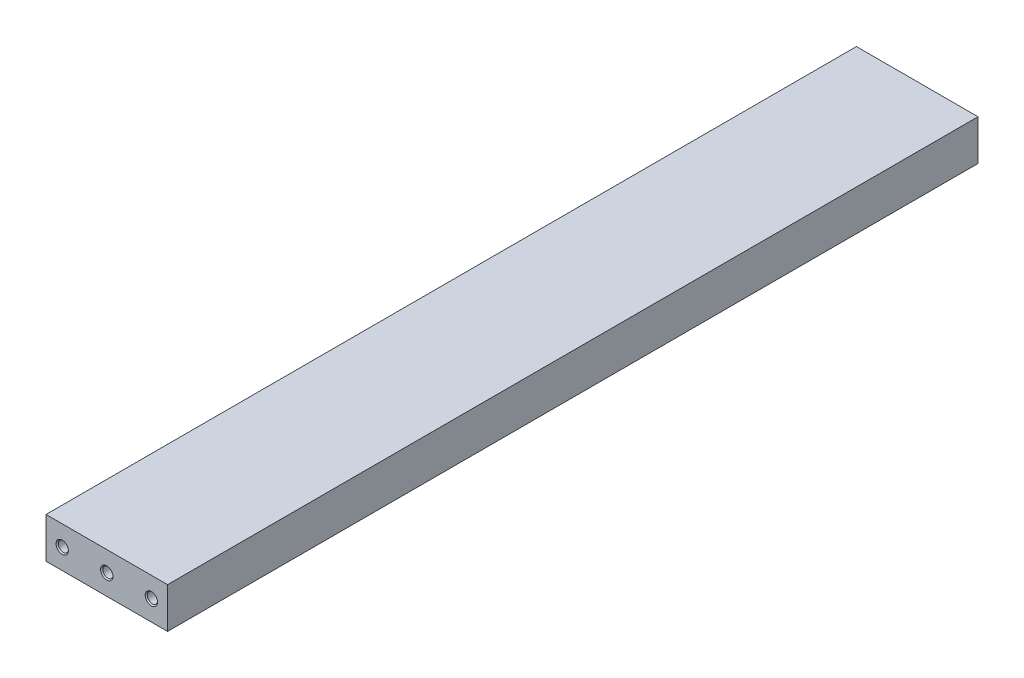
ISO-10303-21;
HEADER;
FILE_DESCRIPTION(('STEP AP214'),'2;1');
FILE_NAME('part.step','',(''),(''),'','','');
FILE_SCHEMA(('AUTOMOTIVE_DESIGN { 1 0 10303 214 1 1 1 1 }'));
ENDSEC;
DATA;
#1=APPLICATION_CONTEXT('core data for automotive mechanical design processes');
#2=APPLICATION_PROTOCOL_DEFINITION('international standard','automotive_design',2000,#1);
#3=PRODUCT_CONTEXT('',#1,'mechanical');
#4=PRODUCT('Part','Part','',(#3));
#5=PRODUCT_RELATED_PRODUCT_CATEGORY('part','',(#4));
#6=PRODUCT_DEFINITION_FORMATION('','',#4);
#7=PRODUCT_DEFINITION_CONTEXT('part definition',#1,'design');
#8=PRODUCT_DEFINITION('design','',#6,#7);
#9=PRODUCT_DEFINITION_SHAPE('','',#8);
#10=(LENGTH_UNIT() NAMED_UNIT(*) SI_UNIT(.MILLI.,.METRE.));
#11=(NAMED_UNIT(*) PLANE_ANGLE_UNIT() SI_UNIT($,.RADIAN.));
#12=(NAMED_UNIT(*) SI_UNIT($,.STERADIAN.) SOLID_ANGLE_UNIT());
#13=UNCERTAINTY_MEASURE_WITH_UNIT(LENGTH_MEASURE(1.E-05),#10,'distance_accuracy_value','');
#14=(GEOMETRIC_REPRESENTATION_CONTEXT(3) GLOBAL_UNCERTAINTY_ASSIGNED_CONTEXT((#13)) GLOBAL_UNIT_ASSIGNED_CONTEXT((#10,
#11,#12)) REPRESENTATION_CONTEXT('',''));
#15=CARTESIAN_POINT('',(0.,0.,0.));
#16=DIRECTION('',(0.,0.,1.));
#17=DIRECTION('',(1.,0.,0.));
#18=AXIS2_PLACEMENT_3D('',#15,#16,#17);
#19=CARTESIAN_POINT('',(0.,0.,210.));
#20=DIRECTION('',(1.,0.,0.));
#21=DIRECTION('',(0.,0.,-1.));
#22=AXIS2_PLACEMENT_3D('',#19,#20,#21);
#23=PLANE('',#22);
#24=DIRECTION('',(0.,1.,0.));
#25=VECTOR('',#24,1.);
#26=CARTESIAN_POINT('',(0.,0.,5.));
#27=LINE('',#26,#25);
#28=CARTESIAN_POINT('',(0.,0.,5.));
#29=VERTEX_POINT('',#28);
#30=CARTESIAN_POINT('',(0.,10.,5.));
#31=VERTEX_POINT('',#30);
#32=EDGE_CURVE('E53',#29,#31,#27,.T.);
#33=ORIENTED_EDGE('',*,*,#32,.F.);
#34=DIRECTION('',(0.,0.,-1.));
#35=VECTOR('',#34,1.);
#36=CARTESIAN_POINT('',(0.,0.,210.));
#37=LINE('',#36,#35);
#38=CARTESIAN_POINT('',(0.,0.,205.));
#39=VERTEX_POINT('',#38);
#40=EDGE_CURVE('E11',#39,#29,#37,.T.);
#41=ORIENTED_EDGE('',*,*,#40,.F.);
#42=DIRECTION('',(0.,1.,0.));
#43=VECTOR('',#42,1.);
#44=CARTESIAN_POINT('',(0.,0.,205.));
#45=LINE('',#44,#43);
#46=CARTESIAN_POINT('',(0.,10.,205.));
#47=VERTEX_POINT('',#46);
#48=EDGE_CURVE('E170',#39,#47,#45,.T.);
#49=ORIENTED_EDGE('',*,*,#48,.T.);
#50=DIRECTION('',(0.,0.,-1.));
#51=VECTOR('',#50,1.);
#52=CARTESIAN_POINT('',(0.,10.,210.));
#53=LINE('',#52,#51);
#54=EDGE_CURVE('E173',#47,#31,#53,.T.);
#55=ORIENTED_EDGE('',*,*,#54,.T.);
#56=EDGE_LOOP('',(#33,#41,#49,#55));
#57=FACE_BOUND('',#56,.T.);
#58=ADVANCED_FACE('F39',(#57),#23,.F.);
#59=CARTESIAN_POINT('',(0.,0.,210.));
#60=DIRECTION('',(0.,1.,0.));
#61=DIRECTION('',(0.,0.,1.));
#62=AXIS2_PLACEMENT_3D('',#59,#60,#61);
#63=PLANE('',#62);
#64=DIRECTION('',(-1.,0.,0.));
#65=VECTOR('',#64,1.);
#66=CARTESIAN_POINT('',(30.,0.,5.));
#67=LINE('',#66,#65);
#68=CARTESIAN_POINT('',(30.,0.,5.));
#69=VERTEX_POINT('',#68);
#70=EDGE_CURVE('E158',#69,#29,#67,.T.);
#71=ORIENTED_EDGE('',*,*,#70,.F.);
#72=DIRECTION('',(0.,0.,-1.));
#73=VECTOR('',#72,1.);
#74=CARTESIAN_POINT('',(30.,0.,210.));
#75=LINE('',#74,#73);
#76=CARTESIAN_POINT('',(30.,0.,205.));
#77=VERTEX_POINT('',#76);
#78=EDGE_CURVE('E46',#77,#69,#75,.T.);
#79=ORIENTED_EDGE('',*,*,#78,.F.);
#80=DIRECTION('',(-1.,0.,0.));
#81=VECTOR('',#80,1.);
#82=CARTESIAN_POINT('',(30.,0.,205.));
#83=LINE('',#82,#81);
#84=EDGE_CURVE('E166',#77,#39,#83,.T.);
#85=ORIENTED_EDGE('',*,*,#84,.T.);
#86=ORIENTED_EDGE('',*,*,#40,.T.);
#87=EDGE_LOOP('',(#71,#79,#85,#86));
#88=FACE_BOUND('',#87,.T.);
#89=ADVANCED_FACE('F186',(#88),#63,.F.);
#90=CARTESIAN_POINT('',(30.,0.,210.));
#91=DIRECTION('',(-1.,0.,0.));
#92=DIRECTION('',(0.,0.,1.));
#93=AXIS2_PLACEMENT_3D('',#90,#91,#92);
#94=PLANE('',#93);
#95=DIRECTION('',(0.,1.,0.));
#96=VECTOR('',#95,1.);
#97=CARTESIAN_POINT('',(30.,0.,5.));
#98=LINE('',#97,#96);
#99=CARTESIAN_POINT('',(30.,10.,5.));
#100=VERTEX_POINT('',#99);
#101=EDGE_CURVE('E161',#69,#100,#98,.T.);
#102=ORIENTED_EDGE('',*,*,#101,.T.);
#103=DIRECTION('',(0.,0.,-1.));
#104=VECTOR('',#103,1.);
#105=CARTESIAN_POINT('',(30.,10.,210.));
#106=LINE('',#105,#104);
#107=CARTESIAN_POINT('',(30.,10.,205.));
#108=VERTEX_POINT('',#107);
#109=EDGE_CURVE('E177',#108,#100,#106,.T.);
#110=ORIENTED_EDGE('',*,*,#109,.F.);
#111=DIRECTION('',(0.,1.,0.));
#112=VECTOR('',#111,1.);
#113=CARTESIAN_POINT('',(30.,0.,205.));
#114=LINE('',#113,#112);
#115=EDGE_CURVE('E61',#77,#108,#114,.T.);
#116=ORIENTED_EDGE('',*,*,#115,.F.);
#117=ORIENTED_EDGE('',*,*,#78,.T.);
#118=EDGE_LOOP('',(#102,#110,#116,#117));
#119=FACE_BOUND('',#118,.T.);
#120=ADVANCED_FACE('F182',(#119),#94,.F.);
#121=CARTESIAN_POINT('',(0.,10.,210.));
#122=DIRECTION('',(0.,-1.,0.));
#123=DIRECTION('',(0.,0.,-1.));
#124=AXIS2_PLACEMENT_3D('',#121,#122,#123);
#125=PLANE('',#124);
#126=DIRECTION('',(-1.,0.,0.));
#127=VECTOR('',#126,1.);
#128=CARTESIAN_POINT('',(30.,10.,5.));
#129=LINE('',#128,#127);
#130=EDGE_CURVE('E157',#100,#31,#129,.T.);
#131=ORIENTED_EDGE('',*,*,#130,.T.);
#132=ORIENTED_EDGE('',*,*,#54,.F.);
#133=DIRECTION('',(-1.,0.,0.));
#134=VECTOR('',#133,1.);
#135=CARTESIAN_POINT('',(30.,10.,205.));
#136=LINE('',#135,#134);
#137=EDGE_CURVE('E164',#108,#47,#136,.T.);
#138=ORIENTED_EDGE('',*,*,#137,.F.);
#139=ORIENTED_EDGE('',*,*,#109,.T.);
#140=EDGE_LOOP('',(#131,#132,#138,#139));
#141=FACE_BOUND('',#140,.T.);
#142=ADVANCED_FACE('F192',(#141),#125,.F.);
#143=CARTESIAN_POINT('',(30.,0.,205.));
#144=DIRECTION('',(0.,0.,-1.));
#145=DIRECTION('',(-1.,0.,0.));
#146=AXIS2_PLACEMENT_3D('',#143,#144,#145);
#147=PLANE('',#146);
#148=CARTESIAN_POINT('',(4.,5.,205.));
#149=DIRECTION('',(0.,0.,1.));
#150=DIRECTION('',(1.,0.,0.));
#151=AXIS2_PLACEMENT_3D('',#148,#149,#150);
#152=CIRCLE('',#151,1.525);
#153=CARTESIAN_POINT('',(5.525,5.,205.));
#154=VERTEX_POINT('',#153);
#155=EDGE_CURVE('E130',#154,#154,#152,.T.);
#156=ORIENTED_EDGE('',*,*,#155,.F.);
#157=EDGE_LOOP('',(#156));
#158=FACE_BOUND('',#157,.T.);
#159=CARTESIAN_POINT('',(15.,5.,205.));
#160=DIRECTION('',(0.,0.,1.));
#161=DIRECTION('',(1.,0.,0.));
#162=AXIS2_PLACEMENT_3D('',#159,#160,#161);
#163=CIRCLE('',#162,1.525);
#164=CARTESIAN_POINT('',(16.525,5.,205.));
#165=VERTEX_POINT('',#164);
#166=EDGE_CURVE('E139',#165,#165,#163,.T.);
#167=ORIENTED_EDGE('',*,*,#166,.F.);
#168=EDGE_LOOP('',(#167));
#169=FACE_BOUND('',#168,.T.);
#170=CARTESIAN_POINT('',(26.,5.,205.));
#171=DIRECTION('',(0.,0.,1.));
#172=DIRECTION('',(1.,0.,0.));
#173=AXIS2_PLACEMENT_3D('',#170,#171,#172);
#174=CIRCLE('',#173,1.525);
#175=CARTESIAN_POINT('',(27.525,5.,205.));
#176=VERTEX_POINT('',#175);
#177=EDGE_CURVE('E148',#176,#176,#174,.T.);
#178=ORIENTED_EDGE('',*,*,#177,.F.);
#179=EDGE_LOOP('',(#178));
#180=FACE_BOUND('',#179,.T.);
#181=ORIENTED_EDGE('',*,*,#137,.T.);
#182=ORIENTED_EDGE('',*,*,#48,.F.);
#183=ORIENTED_EDGE('',*,*,#84,.F.);
#184=ORIENTED_EDGE('',*,*,#115,.T.);
#185=EDGE_LOOP('',(#181,#182,#183,#184));
#186=FACE_BOUND('',#185,.T.);
#187=ADVANCED_FACE('F193',(#158,#169,#180,#186),#147,.F.);
#188=CARTESIAN_POINT('',(30.,0.,5.));
#189=DIRECTION('',(0.,0.,-1.));
#190=DIRECTION('',(-1.,0.,0.));
#191=AXIS2_PLACEMENT_3D('',#188,#189,#190);
#192=PLANE('',#191);
#193=CARTESIAN_POINT('',(4.,5.,5.));
#194=DIRECTION('',(0.,0.,-1.));
#195=DIRECTION('',(-1.,0.,0.));
#196=AXIS2_PLACEMENT_3D('',#193,#194,#195);
#197=CIRCLE('',#196,1.525);
#198=CARTESIAN_POINT('',(2.475,5.,5.));
#199=VERTEX_POINT('',#198);
#200=EDGE_CURVE('E112',#199,#199,#197,.T.);
#201=ORIENTED_EDGE('',*,*,#200,.F.);
#202=EDGE_LOOP('',(#201));
#203=FACE_BOUND('',#202,.T.);
#204=CARTESIAN_POINT('',(15.,5.,5.));
#205=DIRECTION('',(0.,0.,-1.));
#206=DIRECTION('',(-1.,0.,0.));
#207=AXIS2_PLACEMENT_3D('',#204,#205,#206);
#208=CIRCLE('',#207,1.525);
#209=CARTESIAN_POINT('',(13.475,5.,5.));
#210=VERTEX_POINT('',#209);
#211=EDGE_CURVE('E105',#210,#210,#208,.T.);
#212=ORIENTED_EDGE('',*,*,#211,.F.);
#213=EDGE_LOOP('',(#212));
#214=FACE_BOUND('',#213,.T.);
#215=CARTESIAN_POINT('',(26.,5.,5.));
#216=DIRECTION('',(0.,0.,-1.));
#217=DIRECTION('',(-1.,0.,0.));
#218=AXIS2_PLACEMENT_3D('',#215,#216,#217);
#219=CIRCLE('',#218,1.525);
#220=CARTESIAN_POINT('',(24.475,5.,5.));
#221=VERTEX_POINT('',#220);
#222=EDGE_CURVE('E121',#221,#221,#219,.T.);
#223=ORIENTED_EDGE('',*,*,#222,.F.);
#224=EDGE_LOOP('',(#223));
#225=FACE_BOUND('',#224,.T.);
#226=ORIENTED_EDGE('',*,*,#130,.F.);
#227=ORIENTED_EDGE('',*,*,#101,.F.);
#228=ORIENTED_EDGE('',*,*,#70,.T.);
#229=ORIENTED_EDGE('',*,*,#32,.T.);
#230=EDGE_LOOP('',(#226,#227,#228,#229));
#231=FACE_BOUND('',#230,.T.);
#232=ADVANCED_FACE('F188',(#203,#214,#225,#231),#192,.T.);
#233=CARTESIAN_POINT('',(26.,5.,196.5));
#234=DIRECTION('',(0.,0.,1.));
#235=DIRECTION('',(1.,0.,0.));
#236=AXIS2_PLACEMENT_3D('',#233,#234,#235);
#237=CONICAL_SURFACE('',#236,1.25,1.02974425867666);
#238=CARTESIAN_POINT('',(26.,5.,195.748924226216));
#239=VERTEX_POINT('',#238);
#240=VERTEX_LOOP('',#239);
#241=FACE_BOUND('',#240,.T.);
#242=CARTESIAN_POINT('',(26.,5.,196.5));
#243=DIRECTION('',(0.,0.,1.));
#244=DIRECTION('',(1.,0.,0.));
#245=AXIS2_PLACEMENT_3D('',#242,#243,#244);
#246=CIRCLE('',#245,1.25);
#247=CARTESIAN_POINT('',(27.25,5.,196.5));
#248=VERTEX_POINT('',#247);
#249=EDGE_CURVE('E154',#248,#248,#246,.T.);
#250=ORIENTED_EDGE('',*,*,#249,.T.);
#251=EDGE_LOOP('',(#250));
#252=FACE_BOUND('',#251,.T.);
#253=ADVANCED_FACE('F201',(#241,#252),#237,.F.);
#254=CARTESIAN_POINT('',(26.,5.,205.));
#255=DIRECTION('',(0.,0.,1.));
#256=DIRECTION('',(1.,0.,0.));
#257=AXIS2_PLACEMENT_3D('',#254,#255,#256);
#258=CYLINDRICAL_SURFACE('',#257,1.25);
#259=ORIENTED_EDGE('',*,*,#249,.F.);
#260=EDGE_LOOP('',(#259));
#261=FACE_BOUND('',#260,.T.);
#262=CARTESIAN_POINT('',(26.,5.,204.725));
#263=DIRECTION('',(0.,0.,1.));
#264=DIRECTION('',(1.,0.,0.));
#265=AXIS2_PLACEMENT_3D('',#262,#263,#264);
#266=CIRCLE('',#265,1.25);
#267=CARTESIAN_POINT('',(27.25,5.,204.725));
#268=VERTEX_POINT('',#267);
#269=EDGE_CURVE('E151',#268,#268,#266,.T.);
#270=ORIENTED_EDGE('',*,*,#269,.T.);
#271=EDGE_LOOP('',(#270));
#272=FACE_BOUND('',#271,.T.);
#273=ADVANCED_FACE('F234',(#261,#272),#258,.F.);
#274=CARTESIAN_POINT('',(26.,5.,205.));
#275=DIRECTION('',(0.,0.,1.));
#276=DIRECTION('',(1.,0.,0.));
#277=AXIS2_PLACEMENT_3D('',#274,#275,#276);
#278=CONICAL_SURFACE('',#277,1.525,0.785398163397455);
#279=ORIENTED_EDGE('',*,*,#269,.F.);
#280=EDGE_LOOP('',(#279));
#281=FACE_BOUND('',#280,.T.);
#282=ORIENTED_EDGE('',*,*,#177,.T.);
#283=EDGE_LOOP('',(#282));
#284=FACE_BOUND('',#283,.T.);
#285=ADVANCED_FACE('F246',(#281,#284),#278,.F.);
#286=CARTESIAN_POINT('',(15.,5.,196.5));
#287=DIRECTION('',(0.,0.,1.));
#288=DIRECTION('',(1.,0.,0.));
#289=AXIS2_PLACEMENT_3D('',#286,#287,#288);
#290=CONICAL_SURFACE('',#289,1.25,1.02974425867666);
#291=CARTESIAN_POINT('',(15.,5.,195.748924226216));
#292=VERTEX_POINT('',#291);
#293=VERTEX_LOOP('',#292);
#294=FACE_BOUND('',#293,.T.);
#295=CARTESIAN_POINT('',(15.,5.,196.5));
#296=DIRECTION('',(0.,0.,1.));
#297=DIRECTION('',(1.,0.,0.));
#298=AXIS2_PLACEMENT_3D('',#295,#296,#297);
#299=CIRCLE('',#298,1.25);
#300=CARTESIAN_POINT('',(16.25,5.,196.5));
#301=VERTEX_POINT('',#300);
#302=EDGE_CURVE('E145',#301,#301,#299,.T.);
#303=ORIENTED_EDGE('',*,*,#302,.T.);
#304=EDGE_LOOP('',(#303));
#305=FACE_BOUND('',#304,.T.);
#306=ADVANCED_FACE('F259',(#294,#305),#290,.F.);
#307=CARTESIAN_POINT('',(15.,5.,205.));
#308=DIRECTION('',(0.,0.,1.));
#309=DIRECTION('',(1.,0.,0.));
#310=AXIS2_PLACEMENT_3D('',#307,#308,#309);
#311=CYLINDRICAL_SURFACE('',#310,1.25);
#312=ORIENTED_EDGE('',*,*,#302,.F.);
#313=EDGE_LOOP('',(#312));
#314=FACE_BOUND('',#313,.T.);
#315=CARTESIAN_POINT('',(15.,5.,204.725));
#316=DIRECTION('',(0.,0.,1.));
#317=DIRECTION('',(1.,0.,0.));
#318=AXIS2_PLACEMENT_3D('',#315,#316,#317);
#319=CIRCLE('',#318,1.25);
#320=CARTESIAN_POINT('',(16.25,5.,204.725));
#321=VERTEX_POINT('',#320);
#322=EDGE_CURVE('E142',#321,#321,#319,.T.);
#323=ORIENTED_EDGE('',*,*,#322,.T.);
#324=EDGE_LOOP('',(#323));
#325=FACE_BOUND('',#324,.T.);
#326=ADVANCED_FACE('F269',(#314,#325),#311,.F.);
#327=CARTESIAN_POINT('',(15.,5.,205.));
#328=DIRECTION('',(0.,0.,1.));
#329=DIRECTION('',(1.,0.,0.));
#330=AXIS2_PLACEMENT_3D('',#327,#328,#329);
#331=CONICAL_SURFACE('',#330,1.525,0.785398163397455);
#332=ORIENTED_EDGE('',*,*,#322,.F.);
#333=EDGE_LOOP('',(#332));
#334=FACE_BOUND('',#333,.T.);
#335=ORIENTED_EDGE('',*,*,#166,.T.);
#336=EDGE_LOOP('',(#335));
#337=FACE_BOUND('',#336,.T.);
#338=ADVANCED_FACE('F279',(#334,#337),#331,.F.);
#339=CARTESIAN_POINT('',(4.,5.,196.5));
#340=DIRECTION('',(0.,0.,1.));
#341=DIRECTION('',(1.,0.,0.));
#342=AXIS2_PLACEMENT_3D('',#339,#340,#341);
#343=CONICAL_SURFACE('',#342,1.25,1.02974425867666);
#344=CARTESIAN_POINT('',(4.,5.,195.748924226216));
#345=VERTEX_POINT('',#344);
#346=VERTEX_LOOP('',#345);
#347=FACE_BOUND('',#346,.T.);
#348=CARTESIAN_POINT('',(4.,5.,196.5));
#349=DIRECTION('',(0.,0.,1.));
#350=DIRECTION('',(1.,0.,0.));
#351=AXIS2_PLACEMENT_3D('',#348,#349,#350);
#352=CIRCLE('',#351,1.25);
#353=CARTESIAN_POINT('',(5.25,5.,196.5));
#354=VERTEX_POINT('',#353);
#355=EDGE_CURVE('E136',#354,#354,#352,.T.);
#356=ORIENTED_EDGE('',*,*,#355,.T.);
#357=EDGE_LOOP('',(#356));
#358=FACE_BOUND('',#357,.T.);
#359=ADVANCED_FACE('F291',(#347,#358),#343,.F.);
#360=CARTESIAN_POINT('',(4.,5.,205.));
#361=DIRECTION('',(0.,0.,1.));
#362=DIRECTION('',(1.,0.,0.));
#363=AXIS2_PLACEMENT_3D('',#360,#361,#362);
#364=CYLINDRICAL_SURFACE('',#363,1.25);
#365=ORIENTED_EDGE('',*,*,#355,.F.);
#366=EDGE_LOOP('',(#365));
#367=FACE_BOUND('',#366,.T.);
#368=CARTESIAN_POINT('',(4.,5.,204.725));
#369=DIRECTION('',(0.,0.,1.));
#370=DIRECTION('',(1.,0.,0.));
#371=AXIS2_PLACEMENT_3D('',#368,#369,#370);
#372=CIRCLE('',#371,1.25);
#373=CARTESIAN_POINT('',(5.25,5.,204.725));
#374=VERTEX_POINT('',#373);
#375=EDGE_CURVE('E133',#374,#374,#372,.T.);
#376=ORIENTED_EDGE('',*,*,#375,.T.);
#377=EDGE_LOOP('',(#376));
#378=FACE_BOUND('',#377,.T.);
#379=ADVANCED_FACE('F301',(#367,#378),#364,.F.);
#380=CARTESIAN_POINT('',(4.,5.,205.));
#381=DIRECTION('',(0.,0.,1.));
#382=DIRECTION('',(1.,0.,0.));
#383=AXIS2_PLACEMENT_3D('',#380,#381,#382);
#384=CONICAL_SURFACE('',#383,1.525,0.785398163397455);
#385=ORIENTED_EDGE('',*,*,#375,.F.);
#386=EDGE_LOOP('',(#385));
#387=FACE_BOUND('',#386,.T.);
#388=ORIENTED_EDGE('',*,*,#155,.T.);
#389=EDGE_LOOP('',(#388));
#390=FACE_BOUND('',#389,.T.);
#391=ADVANCED_FACE('F311',(#387,#390),#384,.F.);
#392=CARTESIAN_POINT('',(26.,5.,13.5));
#393=DIRECTION('',(0.,0.,-1.));
#394=DIRECTION('',(-1.,0.,0.));
#395=AXIS2_PLACEMENT_3D('',#392,#393,#394);
#396=CONICAL_SURFACE('',#395,1.25,1.02974425867665);
#397=CARTESIAN_POINT('',(26.,5.,14.2510757737845));
#398=VERTEX_POINT('',#397);
#399=VERTEX_LOOP('',#398);
#400=FACE_BOUND('',#399,.T.);
#401=CARTESIAN_POINT('',(26.,5.,13.5));
#402=DIRECTION('',(0.,0.,-1.));
#403=DIRECTION('',(-1.,0.,0.));
#404=AXIS2_PLACEMENT_3D('',#401,#402,#403);
#405=CIRCLE('',#404,1.25);
#406=CARTESIAN_POINT('',(24.75,5.,13.5));
#407=VERTEX_POINT('',#406);
#408=EDGE_CURVE('E127',#407,#407,#405,.T.);
#409=ORIENTED_EDGE('',*,*,#408,.T.);
#410=EDGE_LOOP('',(#409));
#411=FACE_BOUND('',#410,.T.);
#412=ADVANCED_FACE('F322',(#400,#411),#396,.F.);
#413=CARTESIAN_POINT('',(26.,5.,5.));
#414=DIRECTION('',(0.,0.,-1.));
#415=DIRECTION('',(-1.,0.,0.));
#416=AXIS2_PLACEMENT_3D('',#413,#414,#415);
#417=CYLINDRICAL_SURFACE('',#416,1.25);
#418=ORIENTED_EDGE('',*,*,#408,.F.);
#419=EDGE_LOOP('',(#418));
#420=FACE_BOUND('',#419,.T.);
#421=CARTESIAN_POINT('',(26.,5.,5.27500000000001));
#422=DIRECTION('',(0.,0.,-1.));
#423=DIRECTION('',(-1.,0.,0.));
#424=AXIS2_PLACEMENT_3D('',#421,#422,#423);
#425=CIRCLE('',#424,1.25);
#426=CARTESIAN_POINT('',(24.75,5.,5.27500000000001));
#427=VERTEX_POINT('',#426);
#428=EDGE_CURVE('E124',#427,#427,#425,.T.);
#429=ORIENTED_EDGE('',*,*,#428,.T.);
#430=EDGE_LOOP('',(#429));
#431=FACE_BOUND('',#430,.T.);
#432=ADVANCED_FACE('F338',(#420,#431),#417,.F.);
#433=CARTESIAN_POINT('',(26.,5.,5.));
#434=DIRECTION('',(0.,0.,-1.));
#435=DIRECTION('',(-1.,0.,0.));
#436=AXIS2_PLACEMENT_3D('',#433,#434,#435);
#437=CONICAL_SURFACE('',#436,1.525,0.785398163397448);
#438=ORIENTED_EDGE('',*,*,#428,.F.);
#439=EDGE_LOOP('',(#438));
#440=FACE_BOUND('',#439,.T.);
#441=ORIENTED_EDGE('',*,*,#222,.T.);
#442=EDGE_LOOP('',(#441));
#443=FACE_BOUND('',#442,.T.);
#444=ADVANCED_FACE('F349',(#440,#443),#437,.F.);
#445=CARTESIAN_POINT('',(15.,5.,13.5));
#446=DIRECTION('',(0.,0.,-1.));
#447=DIRECTION('',(-1.,0.,0.));
#448=AXIS2_PLACEMENT_3D('',#445,#446,#447);
#449=CONICAL_SURFACE('',#448,1.25,1.02974425867665);
#450=CARTESIAN_POINT('',(15.,5.,14.2510757737845));
#451=VERTEX_POINT('',#450);
#452=VERTEX_LOOP('',#451);
#453=FACE_BOUND('',#452,.T.);
#454=CARTESIAN_POINT('',(15.,5.,13.5));
#455=DIRECTION('',(0.,0.,-1.));
#456=DIRECTION('',(-1.,0.,0.));
#457=AXIS2_PLACEMENT_3D('',#454,#455,#456);
#458=CIRCLE('',#457,1.25);
#459=CARTESIAN_POINT('',(13.75,5.,13.5));
#460=VERTEX_POINT('',#459);
#461=EDGE_CURVE('E118',#460,#460,#458,.T.);
#462=ORIENTED_EDGE('',*,*,#461,.T.);
#463=EDGE_LOOP('',(#462));
#464=FACE_BOUND('',#463,.T.);
#465=ADVANCED_FACE('F361',(#453,#464),#449,.F.);
#466=CARTESIAN_POINT('',(15.,5.,5.));
#467=DIRECTION('',(0.,0.,-1.));
#468=DIRECTION('',(-1.,0.,0.));
#469=AXIS2_PLACEMENT_3D('',#466,#467,#468);
#470=CYLINDRICAL_SURFACE('',#469,1.25);
#471=ORIENTED_EDGE('',*,*,#461,.F.);
#472=EDGE_LOOP('',(#471));
#473=FACE_BOUND('',#472,.T.);
#474=CARTESIAN_POINT('',(15.,5.,5.27500000000001));
#475=DIRECTION('',(0.,0.,-1.));
#476=DIRECTION('',(-1.,0.,0.));
#477=AXIS2_PLACEMENT_3D('',#474,#475,#476);
#478=CIRCLE('',#477,1.25);
#479=CARTESIAN_POINT('',(13.75,5.,5.27500000000001));
#480=VERTEX_POINT('',#479);
#481=EDGE_CURVE('E109',#480,#480,#478,.T.);
#482=ORIENTED_EDGE('',*,*,#481,.T.);
#483=EDGE_LOOP('',(#482));
#484=FACE_BOUND('',#483,.T.);
#485=ADVANCED_FACE('F371',(#473,#484),#470,.F.);
#486=CARTESIAN_POINT('',(15.,5.,5.));
#487=DIRECTION('',(0.,0.,-1.));
#488=DIRECTION('',(-1.,0.,0.));
#489=AXIS2_PLACEMENT_3D('',#486,#487,#488);
#490=CONICAL_SURFACE('',#489,1.525,0.785398163397448);
#491=ORIENTED_EDGE('',*,*,#481,.F.);
#492=EDGE_LOOP('',(#491));
#493=FACE_BOUND('',#492,.T.);
#494=ORIENTED_EDGE('',*,*,#211,.T.);
#495=EDGE_LOOP('',(#494));
#496=FACE_BOUND('',#495,.T.);
#497=ADVANCED_FACE('F99',(#493,#496),#490,.F.);
#498=CARTESIAN_POINT('',(4.,5.,13.5));
#499=DIRECTION('',(0.,0.,-1.));
#500=DIRECTION('',(-1.,0.,0.));
#501=AXIS2_PLACEMENT_3D('',#498,#499,#500);
#502=CONICAL_SURFACE('',#501,1.25,1.02974425867665);
#503=CARTESIAN_POINT('',(4.,5.,14.2510757737845));
#504=VERTEX_POINT('',#503);
#505=VERTEX_LOOP('',#504);
#506=FACE_BOUND('',#505,.T.);
#507=CARTESIAN_POINT('',(4.,5.,13.5));
#508=DIRECTION('',(0.,0.,-1.));
#509=DIRECTION('',(-1.,0.,0.));
#510=AXIS2_PLACEMENT_3D('',#507,#508,#509);
#511=CIRCLE('',#510,1.25);
#512=CARTESIAN_POINT('',(2.75,5.,13.5));
#513=VERTEX_POINT('',#512);
#514=EDGE_CURVE('E103',#513,#513,#511,.T.);
#515=ORIENTED_EDGE('',*,*,#514,.T.);
#516=EDGE_LOOP('',(#515));
#517=FACE_BOUND('',#516,.T.);
#518=ADVANCED_FACE('F95',(#506,#517),#502,.F.);
#519=CARTESIAN_POINT('',(4.,5.,5.));
#520=DIRECTION('',(0.,0.,-1.));
#521=DIRECTION('',(-1.,0.,0.));
#522=AXIS2_PLACEMENT_3D('',#519,#520,#521);
#523=CYLINDRICAL_SURFACE('',#522,1.25);
#524=ORIENTED_EDGE('',*,*,#514,.F.);
#525=EDGE_LOOP('',(#524));
#526=FACE_BOUND('',#525,.T.);
#527=CARTESIAN_POINT('',(4.,5.,5.27500000000001));
#528=DIRECTION('',(0.,0.,-1.));
#529=DIRECTION('',(-1.,0.,0.));
#530=AXIS2_PLACEMENT_3D('',#527,#528,#529);
#531=CIRCLE('',#530,1.25);
#532=CARTESIAN_POINT('',(2.75,5.,5.27500000000001));
#533=VERTEX_POINT('',#532);
#534=EDGE_CURVE('E106',#533,#533,#531,.T.);
#535=ORIENTED_EDGE('',*,*,#534,.T.);
#536=EDGE_LOOP('',(#535));
#537=FACE_BOUND('',#536,.T.);
#538=ADVANCED_FACE('F98',(#526,#537),#523,.F.);
#539=CARTESIAN_POINT('',(4.,5.,5.));
#540=DIRECTION('',(0.,0.,-1.));
#541=DIRECTION('',(-1.,0.,0.));
#542=AXIS2_PLACEMENT_3D('',#539,#540,#541);
#543=CONICAL_SURFACE('',#542,1.525,0.785398163397448);
#544=ORIENTED_EDGE('',*,*,#534,.F.);
#545=EDGE_LOOP('',(#544));
#546=FACE_BOUND('',#545,.T.);
#547=ORIENTED_EDGE('',*,*,#200,.T.);
#548=EDGE_LOOP('',(#547));
#549=FACE_BOUND('',#548,.T.);
#550=ADVANCED_FACE('F406',(#546,#549),#543,.F.);
#551=CLOSED_SHELL('',(#58,#89,#120,#142,#187,#232,#253,#273,#285,#306,#326,#338,#359,#379,#391,
#412,#432,#444,#465,#485,#497,#518,#538,#550));
#552=MANIFOLD_SOLID_BREP('B2',#551);
#553=ADVANCED_BREP_SHAPE_REPRESENTATION('',(#18,#552),#14);
#554=SHAPE_DEFINITION_REPRESENTATION(#9,#553);
ENDSEC;
END-ISO-10303-21;
